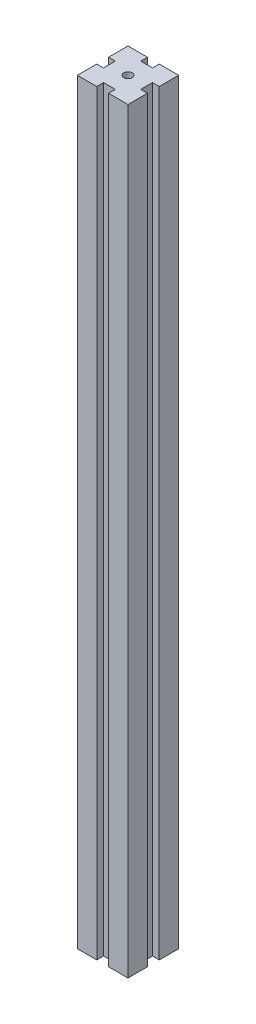
ISO-10303-21;
HEADER;
FILE_DESCRIPTION(('STEP AP214'),'2;1');
FILE_NAME('part.step','',(''),(''),'','','');
FILE_SCHEMA(('AUTOMOTIVE_DESIGN { 1 0 10303 214 1 1 1 1 }'));
ENDSEC;
DATA;
#1=APPLICATION_CONTEXT('core data for automotive mechanical design processes');
#2=APPLICATION_PROTOCOL_DEFINITION('international standard','automotive_design',2000,#1);
#3=PRODUCT_CONTEXT('',#1,'mechanical');
#4=PRODUCT('Part','Part','',(#3));
#5=PRODUCT_RELATED_PRODUCT_CATEGORY('part','',(#4));
#6=PRODUCT_DEFINITION_FORMATION('','',#4);
#7=PRODUCT_DEFINITION_CONTEXT('part definition',#1,'design');
#8=PRODUCT_DEFINITION('design','',#6,#7);
#9=PRODUCT_DEFINITION_SHAPE('','',#8);
#10=(LENGTH_UNIT() NAMED_UNIT(*) SI_UNIT(.MILLI.,.METRE.));
#11=(NAMED_UNIT(*) PLANE_ANGLE_UNIT() SI_UNIT($,.RADIAN.));
#12=(NAMED_UNIT(*) SI_UNIT($,.STERADIAN.) SOLID_ANGLE_UNIT());
#13=UNCERTAINTY_MEASURE_WITH_UNIT(LENGTH_MEASURE(1.E-05),#10,'distance_accuracy_value','');
#14=(GEOMETRIC_REPRESENTATION_CONTEXT(3) GLOBAL_UNCERTAINTY_ASSIGNED_CONTEXT((#13)) GLOBAL_UNIT_ASSIGNED_CONTEXT((#10,
#11,#12)) REPRESENTATION_CONTEXT('',''));
#15=CARTESIAN_POINT('',(0.,0.,0.));
#16=DIRECTION('',(0.,0.,1.));
#17=DIRECTION('',(1.,0.,0.));
#18=AXIS2_PLACEMENT_3D('',#15,#16,#17);
#19=CARTESIAN_POINT('',(0.,224.,-9.25));
#20=DIRECTION('',(0.,0.,-1.));
#21=DIRECTION('',(-1.,0.,0.));
#22=AXIS2_PLACEMENT_3D('',#19,#20,#21);
#23=PLANE('',#22);
#24=DIRECTION('',(1.,0.,0.));
#25=VECTOR('',#24,1.);
#26=CARTESIAN_POINT('',(0.,0.,-9.25));
#27=LINE('',#26,#25);
#28=CARTESIAN_POINT('',(0.,0.,-9.25));
#29=VERTEX_POINT('',#28);
#30=CARTESIAN_POINT('',(2.,0.,-9.25));
#31=VERTEX_POINT('',#30);
#32=EDGE_CURVE('E251',#29,#31,#27,.T.);
#33=ORIENTED_EDGE('',*,*,#32,.T.);
#34=DIRECTION('',(0.,-1.,0.));
#35=VECTOR('',#34,1.);
#36=CARTESIAN_POINT('',(2.,224.,-9.25));
#37=LINE('',#36,#35);
#38=CARTESIAN_POINT('',(2.,224.,-9.25));
#39=VERTEX_POINT('',#38);
#40=EDGE_CURVE('E11',#39,#31,#37,.T.);
#41=ORIENTED_EDGE('',*,*,#40,.F.);
#42=DIRECTION('',(1.,0.,0.));
#43=VECTOR('',#42,1.);
#44=CARTESIAN_POINT('',(0.,224.,-9.25));
#45=LINE('',#44,#43);
#46=CARTESIAN_POINT('',(0.,224.,-9.25));
#47=VERTEX_POINT('',#46);
#48=EDGE_CURVE('E243',#47,#39,#45,.T.);
#49=ORIENTED_EDGE('',*,*,#48,.F.);
#50=DIRECTION('',(0.,-1.,0.));
#51=VECTOR('',#50,1.);
#52=CARTESIAN_POINT('',(0.,224.,-9.25));
#53=LINE('',#52,#51);
#54=EDGE_CURVE('E50',#47,#29,#53,.T.);
#55=ORIENTED_EDGE('',*,*,#54,.T.);
#56=EDGE_LOOP('',(#33,#41,#49,#55));
#57=FACE_BOUND('',#56,.T.);
#58=ADVANCED_FACE('F34',(#57),#23,.F.);
#59=CARTESIAN_POINT('',(2.,224.,0.));
#60=DIRECTION('',(1.,0.,0.));
#61=DIRECTION('',(0.,0.,-1.));
#62=AXIS2_PLACEMENT_3D('',#59,#60,#61);
#63=PLANE('',#62);
#64=DIRECTION('',(0.,0.,1.));
#65=VECTOR('',#64,1.);
#66=CARTESIAN_POINT('',(2.,0.,0.));
#67=LINE('',#66,#65);
#68=CARTESIAN_POINT('',(2.,0.,-5.75));
#69=VERTEX_POINT('',#68);
#70=EDGE_CURVE('E254',#31,#69,#67,.T.);
#71=ORIENTED_EDGE('',*,*,#70,.T.);
#72=DIRECTION('',(0.,-1.,0.));
#73=VECTOR('',#72,1.);
#74=CARTESIAN_POINT('',(2.,224.,-5.75));
#75=LINE('',#74,#73);
#76=CARTESIAN_POINT('',(2.,224.,-5.75));
#77=VERTEX_POINT('',#76);
#78=EDGE_CURVE('E42',#77,#69,#75,.T.);
#79=ORIENTED_EDGE('',*,*,#78,.F.);
#80=DIRECTION('',(0.,0.,1.));
#81=VECTOR('',#80,1.);
#82=CARTESIAN_POINT('',(2.,224.,0.));
#83=LINE('',#82,#81);
#84=EDGE_CURVE('E124',#39,#77,#83,.T.);
#85=ORIENTED_EDGE('',*,*,#84,.F.);
#86=ORIENTED_EDGE('',*,*,#40,.T.);
#87=EDGE_LOOP('',(#71,#79,#85,#86));
#88=FACE_BOUND('',#87,.T.);
#89=ADVANCED_FACE('F339',(#88),#63,.F.);
#90=CARTESIAN_POINT('',(0.,224.,-5.75));
#91=DIRECTION('',(0.,0.,-1.));
#92=DIRECTION('',(-1.,0.,0.));
#93=AXIS2_PLACEMENT_3D('',#90,#91,#92);
#94=PLANE('',#93);
#95=DIRECTION('',(1.,0.,0.));
#96=VECTOR('',#95,1.);
#97=CARTESIAN_POINT('',(0.,0.,-5.75));
#98=LINE('',#97,#96);
#99=CARTESIAN_POINT('',(0.,0.,-5.75));
#100=VERTEX_POINT('',#99);
#101=EDGE_CURVE('E258',#100,#69,#98,.T.);
#102=ORIENTED_EDGE('',*,*,#101,.F.);
#103=DIRECTION('',(0.,-1.,0.));
#104=VECTOR('',#103,1.);
#105=CARTESIAN_POINT('',(0.,224.,-5.75));
#106=LINE('',#105,#104);
#107=CARTESIAN_POINT('',(0.,224.,-5.75));
#108=VERTEX_POINT('',#107);
#109=EDGE_CURVE('E334',#108,#100,#106,.T.);
#110=ORIENTED_EDGE('',*,*,#109,.F.);
#111=DIRECTION('',(1.,0.,0.));
#112=VECTOR('',#111,1.);
#113=CARTESIAN_POINT('',(0.,224.,-5.75));
#114=LINE('',#113,#112);
#115=EDGE_CURVE('E237',#108,#77,#114,.T.);
#116=ORIENTED_EDGE('',*,*,#115,.T.);
#117=ORIENTED_EDGE('',*,*,#78,.T.);
#118=EDGE_LOOP('',(#102,#110,#116,#117));
#119=FACE_BOUND('',#118,.T.);
#120=ADVANCED_FACE('F337',(#119),#94,.T.);
#121=CARTESIAN_POINT('',(0.,224.,0.));
#122=DIRECTION('',(-1.,0.,0.));
#123=DIRECTION('',(0.,0.,1.));
#124=AXIS2_PLACEMENT_3D('',#121,#122,#123);
#125=PLANE('',#124);
#126=DIRECTION('',(0.,0.,-1.));
#127=VECTOR('',#126,1.);
#128=CARTESIAN_POINT('',(0.,0.,0.));
#129=LINE('',#128,#127);
#130=CARTESIAN_POINT('',(0.,0.,0.));
#131=VERTEX_POINT('',#130);
#132=EDGE_CURVE('E264',#131,#100,#129,.T.);
#133=ORIENTED_EDGE('',*,*,#132,.F.);
#134=DIRECTION('',(0.,-1.,0.));
#135=VECTOR('',#134,1.);
#136=CARTESIAN_POINT('',(0.,224.,0.));
#137=LINE('',#136,#135);
#138=CARTESIAN_POINT('',(0.,224.,0.));
#139=VERTEX_POINT('',#138);
#140=EDGE_CURVE('E332',#139,#131,#137,.T.);
#141=ORIENTED_EDGE('',*,*,#140,.F.);
#142=DIRECTION('',(0.,0.,-1.));
#143=VECTOR('',#142,1.);
#144=CARTESIAN_POINT('',(0.,224.,0.));
#145=LINE('',#144,#143);
#146=EDGE_CURVE('E201',#139,#108,#145,.T.);
#147=ORIENTED_EDGE('',*,*,#146,.T.);
#148=ORIENTED_EDGE('',*,*,#109,.T.);
#149=EDGE_LOOP('',(#133,#141,#147,#148));
#150=FACE_BOUND('',#149,.T.);
#151=ADVANCED_FACE('F345',(#150),#125,.T.);
#152=CARTESIAN_POINT('',(0.,224.,0.));
#153=DIRECTION('',(0.,0.,-1.));
#154=DIRECTION('',(-1.,0.,0.));
#155=AXIS2_PLACEMENT_3D('',#152,#153,#154);
#156=PLANE('',#155);
#157=DIRECTION('',(1.,0.,0.));
#158=VECTOR('',#157,1.);
#159=CARTESIAN_POINT('',(0.,0.,0.));
#160=LINE('',#159,#158);
#161=CARTESIAN_POINT('',(5.75,0.,0.));
#162=VERTEX_POINT('',#161);
#163=EDGE_CURVE('E267',#131,#162,#160,.T.);
#164=ORIENTED_EDGE('',*,*,#163,.T.);
#165=DIRECTION('',(0.,-1.,0.));
#166=VECTOR('',#165,1.);
#167=CARTESIAN_POINT('',(5.75,224.,0.));
#168=LINE('',#167,#166);
#169=CARTESIAN_POINT('',(5.75,224.,0.));
#170=VERTEX_POINT('',#169);
#171=EDGE_CURVE('E329',#170,#162,#168,.T.);
#172=ORIENTED_EDGE('',*,*,#171,.F.);
#173=DIRECTION('',(1.,0.,0.));
#174=VECTOR('',#173,1.);
#175=CARTESIAN_POINT('',(0.,224.,0.));
#176=LINE('',#175,#174);
#177=EDGE_CURVE('E225',#139,#170,#176,.T.);
#178=ORIENTED_EDGE('',*,*,#177,.F.);
#179=ORIENTED_EDGE('',*,*,#140,.T.);
#180=EDGE_LOOP('',(#164,#172,#178,#179));
#181=FACE_BOUND('',#180,.T.);
#182=ADVANCED_FACE('F359',(#181),#156,.F.);
#183=CARTESIAN_POINT('',(5.75,224.,0.));
#184=DIRECTION('',(-1.,0.,0.));
#185=DIRECTION('',(0.,0.,1.));
#186=AXIS2_PLACEMENT_3D('',#183,#184,#185);
#187=PLANE('',#186);
#188=DIRECTION('',(0.,0.,-1.));
#189=VECTOR('',#188,1.);
#190=CARTESIAN_POINT('',(5.75,0.,0.));
#191=LINE('',#190,#189);
#192=CARTESIAN_POINT('',(5.75,0.,-2.));
#193=VERTEX_POINT('',#192);
#194=EDGE_CURVE('E269',#162,#193,#191,.T.);
#195=ORIENTED_EDGE('',*,*,#194,.T.);
#196=DIRECTION('',(0.,-1.,0.));
#197=VECTOR('',#196,1.);
#198=CARTESIAN_POINT('',(5.75,224.,-2.));
#199=LINE('',#198,#197);
#200=CARTESIAN_POINT('',(5.75,224.,-2.));
#201=VERTEX_POINT('',#200);
#202=EDGE_CURVE('E326',#201,#193,#199,.T.);
#203=ORIENTED_EDGE('',*,*,#202,.F.);
#204=DIRECTION('',(0.,0.,-1.));
#205=VECTOR('',#204,1.);
#206=CARTESIAN_POINT('',(5.75,224.,0.));
#207=LINE('',#206,#205);
#208=EDGE_CURVE('E232',#170,#201,#207,.T.);
#209=ORIENTED_EDGE('',*,*,#208,.F.);
#210=ORIENTED_EDGE('',*,*,#171,.T.);
#211=EDGE_LOOP('',(#195,#203,#209,#210));
#212=FACE_BOUND('',#211,.T.);
#213=ADVANCED_FACE('F355',(#212),#187,.F.);
#214=CARTESIAN_POINT('',(0.,224.,-2.));
#215=DIRECTION('',(0.,0.,-1.));
#216=DIRECTION('',(-1.,0.,0.));
#217=AXIS2_PLACEMENT_3D('',#214,#215,#216);
#218=PLANE('',#217);
#219=DIRECTION('',(1.,0.,0.));
#220=VECTOR('',#219,1.);
#221=CARTESIAN_POINT('',(0.,0.,-2.));
#222=LINE('',#221,#220);
#223=CARTESIAN_POINT('',(9.25,0.,-2.));
#224=VERTEX_POINT('',#223);
#225=EDGE_CURVE('E272',#193,#224,#222,.T.);
#226=ORIENTED_EDGE('',*,*,#225,.T.);
#227=DIRECTION('',(0.,-1.,0.));
#228=VECTOR('',#227,1.);
#229=CARTESIAN_POINT('',(9.25,224.,-2.));
#230=LINE('',#229,#228);
#231=CARTESIAN_POINT('',(9.25,224.,-2.));
#232=VERTEX_POINT('',#231);
#233=EDGE_CURVE('E324',#232,#224,#230,.T.);
#234=ORIENTED_EDGE('',*,*,#233,.F.);
#235=DIRECTION('',(1.,0.,0.));
#236=VECTOR('',#235,1.);
#237=CARTESIAN_POINT('',(0.,224.,-2.));
#238=LINE('',#237,#236);
#239=EDGE_CURVE('E230',#201,#232,#238,.T.);
#240=ORIENTED_EDGE('',*,*,#239,.F.);
#241=ORIENTED_EDGE('',*,*,#202,.T.);
#242=EDGE_LOOP('',(#226,#234,#240,#241));
#243=FACE_BOUND('',#242,.T.);
#244=ADVANCED_FACE('F358',(#243),#218,.F.);
#245=CARTESIAN_POINT('',(9.25,224.,0.));
#246=DIRECTION('',(-1.,0.,0.));
#247=DIRECTION('',(0.,0.,1.));
#248=AXIS2_PLACEMENT_3D('',#245,#246,#247);
#249=PLANE('',#248);
#250=DIRECTION('',(0.,0.,-1.));
#251=VECTOR('',#250,1.);
#252=CARTESIAN_POINT('',(9.25,0.,0.));
#253=LINE('',#252,#251);
#254=CARTESIAN_POINT('',(9.25,0.,0.));
#255=VERTEX_POINT('',#254);
#256=EDGE_CURVE('E275',#255,#224,#253,.T.);
#257=ORIENTED_EDGE('',*,*,#256,.F.);
#258=DIRECTION('',(0.,-1.,0.));
#259=VECTOR('',#258,1.);
#260=CARTESIAN_POINT('',(9.25,224.,0.));
#261=LINE('',#260,#259);
#262=CARTESIAN_POINT('',(9.25,224.,0.));
#263=VERTEX_POINT('',#262);
#264=EDGE_CURVE('E322',#263,#255,#261,.T.);
#265=ORIENTED_EDGE('',*,*,#264,.F.);
#266=DIRECTION('',(0.,0.,-1.));
#267=VECTOR('',#266,1.);
#268=CARTESIAN_POINT('',(9.25,224.,0.));
#269=LINE('',#268,#267);
#270=EDGE_CURVE('E223',#263,#232,#269,.T.);
#271=ORIENTED_EDGE('',*,*,#270,.T.);
#272=ORIENTED_EDGE('',*,*,#233,.T.);
#273=EDGE_LOOP('',(#257,#265,#271,#272));
#274=FACE_BOUND('',#273,.T.);
#275=ADVANCED_FACE('F363',(#274),#249,.T.);
#276=CARTESIAN_POINT('',(15.,0.,0.));
#277=VERTEX_POINT('',#276);
#278=EDGE_CURVE('E270',#255,#277,#160,.T.);
#279=ORIENTED_EDGE('',*,*,#278,.T.);
#280=DIRECTION('',(0.,-1.,0.));
#281=VECTOR('',#280,1.);
#282=CARTESIAN_POINT('',(15.,224.,0.));
#283=LINE('',#282,#281);
#284=CARTESIAN_POINT('',(15.,224.,0.));
#285=VERTEX_POINT('',#284);
#286=EDGE_CURVE('E319',#285,#277,#283,.T.);
#287=ORIENTED_EDGE('',*,*,#286,.F.);
#288=EDGE_CURVE('E220',#263,#285,#176,.T.);
#289=ORIENTED_EDGE('',*,*,#288,.F.);
#290=ORIENTED_EDGE('',*,*,#264,.T.);
#291=EDGE_LOOP('',(#279,#287,#289,#290));
#292=FACE_BOUND('',#291,.T.);
#293=ADVANCED_FACE('F367',(#292),#156,.F.);
#294=CARTESIAN_POINT('',(15.,224.,0.));
#295=DIRECTION('',(-1.,0.,0.));
#296=DIRECTION('',(0.,0.,1.));
#297=AXIS2_PLACEMENT_3D('',#294,#295,#296);
#298=PLANE('',#297);
#299=DIRECTION('',(0.,0.,-1.));
#300=VECTOR('',#299,1.);
#301=CARTESIAN_POINT('',(15.,0.,0.));
#302=LINE('',#301,#300);
#303=CARTESIAN_POINT('',(15.,0.,-5.75));
#304=VERTEX_POINT('',#303);
#305=EDGE_CURVE('E278',#277,#304,#302,.T.);
#306=ORIENTED_EDGE('',*,*,#305,.T.);
#307=DIRECTION('',(0.,-1.,0.));
#308=VECTOR('',#307,1.);
#309=CARTESIAN_POINT('',(15.,224.,-5.75));
#310=LINE('',#309,#308);
#311=CARTESIAN_POINT('',(15.,224.,-5.75));
#312=VERTEX_POINT('',#311);
#313=EDGE_CURVE('E316',#312,#304,#310,.T.);
#314=ORIENTED_EDGE('',*,*,#313,.F.);
#315=DIRECTION('',(0.,0.,-1.));
#316=VECTOR('',#315,1.);
#317=CARTESIAN_POINT('',(15.,224.,0.));
#318=LINE('',#317,#316);
#319=EDGE_CURVE('E211',#285,#312,#318,.T.);
#320=ORIENTED_EDGE('',*,*,#319,.F.);
#321=ORIENTED_EDGE('',*,*,#286,.T.);
#322=EDGE_LOOP('',(#306,#314,#320,#321));
#323=FACE_BOUND('',#322,.T.);
#324=ADVANCED_FACE('F371',(#323),#298,.F.);
#325=CARTESIAN_POINT('',(0.,224.,-5.74999999999999));
#326=DIRECTION('',(0.,0.,1.));
#327=DIRECTION('',(1.,0.,0.));
#328=AXIS2_PLACEMENT_3D('',#325,#326,#327);
#329=PLANE('',#328);
#330=DIRECTION('',(-1.,0.,0.));
#331=VECTOR('',#330,1.);
#332=CARTESIAN_POINT('',(0.,0.,-5.74999999999999));
#333=LINE('',#332,#331);
#334=CARTESIAN_POINT('',(13.,0.,-5.75));
#335=VERTEX_POINT('',#334);
#336=EDGE_CURVE('E280',#304,#335,#333,.T.);
#337=ORIENTED_EDGE('',*,*,#336,.T.);
#338=DIRECTION('',(0.,-1.,0.));
#339=VECTOR('',#338,1.);
#340=CARTESIAN_POINT('',(13.,224.,-5.75));
#341=LINE('',#340,#339);
#342=CARTESIAN_POINT('',(13.,224.,-5.75));
#343=VERTEX_POINT('',#342);
#344=EDGE_CURVE('E314',#343,#335,#341,.T.);
#345=ORIENTED_EDGE('',*,*,#344,.F.);
#346=DIRECTION('',(-1.,0.,0.));
#347=VECTOR('',#346,1.);
#348=CARTESIAN_POINT('',(0.,224.,-5.74999999999999));
#349=LINE('',#348,#347);
#350=EDGE_CURVE('E219',#312,#343,#349,.T.);
#351=ORIENTED_EDGE('',*,*,#350,.F.);
#352=ORIENTED_EDGE('',*,*,#313,.T.);
#353=EDGE_LOOP('',(#337,#345,#351,#352));
#354=FACE_BOUND('',#353,.T.);
#355=ADVANCED_FACE('F373',(#354),#329,.F.);
#356=CARTESIAN_POINT('',(13.,224.,0.));
#357=DIRECTION('',(1.,0.,0.));
#358=DIRECTION('',(0.,0.,-1.));
#359=AXIS2_PLACEMENT_3D('',#356,#357,#358);
#360=PLANE('',#359);
#361=DIRECTION('',(0.,0.,1.));
#362=VECTOR('',#361,1.);
#363=CARTESIAN_POINT('',(13.,0.,0.));
#364=LINE('',#363,#362);
#365=CARTESIAN_POINT('',(13.,0.,-9.25));
#366=VERTEX_POINT('',#365);
#367=EDGE_CURVE('E284',#366,#335,#364,.T.);
#368=ORIENTED_EDGE('',*,*,#367,.F.);
#369=DIRECTION('',(0.,-1.,0.));
#370=VECTOR('',#369,1.);
#371=CARTESIAN_POINT('',(13.,224.,-9.25));
#372=LINE('',#371,#370);
#373=CARTESIAN_POINT('',(13.,224.,-9.25));
#374=VERTEX_POINT('',#373);
#375=EDGE_CURVE('E312',#374,#366,#372,.T.);
#376=ORIENTED_EDGE('',*,*,#375,.F.);
#377=DIRECTION('',(0.,0.,1.));
#378=VECTOR('',#377,1.);
#379=CARTESIAN_POINT('',(13.,224.,0.));
#380=LINE('',#379,#378);
#381=EDGE_CURVE('E216',#374,#343,#380,.T.);
#382=ORIENTED_EDGE('',*,*,#381,.T.);
#383=ORIENTED_EDGE('',*,*,#344,.T.);
#384=EDGE_LOOP('',(#368,#376,#382,#383));
#385=FACE_BOUND('',#384,.T.);
#386=ADVANCED_FACE('F376',(#385),#360,.T.);
#387=CARTESIAN_POINT('',(0.,224.,-9.25));
#388=DIRECTION('',(0.,0.,1.));
#389=DIRECTION('',(1.,0.,0.));
#390=AXIS2_PLACEMENT_3D('',#387,#388,#389);
#391=PLANE('',#390);
#392=DIRECTION('',(-1.,0.,0.));
#393=VECTOR('',#392,1.);
#394=CARTESIAN_POINT('',(0.,0.,-9.25));
#395=LINE('',#394,#393);
#396=CARTESIAN_POINT('',(15.,0.,-9.25));
#397=VERTEX_POINT('',#396);
#398=EDGE_CURVE('E287',#397,#366,#395,.T.);
#399=ORIENTED_EDGE('',*,*,#398,.F.);
#400=DIRECTION('',(0.,-1.,0.));
#401=VECTOR('',#400,1.);
#402=CARTESIAN_POINT('',(15.,224.,-9.25));
#403=LINE('',#402,#401);
#404=CARTESIAN_POINT('',(15.,224.,-9.25));
#405=VERTEX_POINT('',#404);
#406=EDGE_CURVE('E310',#405,#397,#403,.T.);
#407=ORIENTED_EDGE('',*,*,#406,.F.);
#408=DIRECTION('',(-1.,0.,0.));
#409=VECTOR('',#408,1.);
#410=CARTESIAN_POINT('',(0.,224.,-9.25));
#411=LINE('',#410,#409);
#412=EDGE_CURVE('E209',#405,#374,#411,.T.);
#413=ORIENTED_EDGE('',*,*,#412,.T.);
#414=ORIENTED_EDGE('',*,*,#375,.T.);
#415=EDGE_LOOP('',(#399,#407,#413,#414));
#416=FACE_BOUND('',#415,.T.);
#417=ADVANCED_FACE('F380',(#416),#391,.T.);
#418=CARTESIAN_POINT('',(15.,0.,-15.));
#419=VERTEX_POINT('',#418);
#420=EDGE_CURVE('E281',#397,#419,#302,.T.);
#421=ORIENTED_EDGE('',*,*,#420,.T.);
#422=DIRECTION('',(0.,-1.,0.));
#423=VECTOR('',#422,1.);
#424=CARTESIAN_POINT('',(15.,224.,-15.));
#425=LINE('',#424,#423);
#426=CARTESIAN_POINT('',(15.,224.,-15.));
#427=VERTEX_POINT('',#426);
#428=EDGE_CURVE('E308',#427,#419,#425,.T.);
#429=ORIENTED_EDGE('',*,*,#428,.F.);
#430=EDGE_CURVE('E206',#405,#427,#318,.T.);
#431=ORIENTED_EDGE('',*,*,#430,.F.);
#432=ORIENTED_EDGE('',*,*,#406,.T.);
#433=EDGE_LOOP('',(#421,#429,#431,#432));
#434=FACE_BOUND('',#433,.T.);
#435=ADVANCED_FACE('F384',(#434),#298,.F.);
#436=CARTESIAN_POINT('',(0.,224.,-15.));
#437=DIRECTION('',(0.,0.,-1.));
#438=DIRECTION('',(-1.,0.,0.));
#439=AXIS2_PLACEMENT_3D('',#436,#437,#438);
#440=PLANE('',#439);
#441=DIRECTION('',(1.,0.,0.));
#442=VECTOR('',#441,1.);
#443=CARTESIAN_POINT('',(0.,0.,-15.));
#444=LINE('',#443,#442);
#445=CARTESIAN_POINT('',(9.25,0.,-15.));
#446=VERTEX_POINT('',#445);
#447=EDGE_CURVE('E290',#446,#419,#444,.T.);
#448=ORIENTED_EDGE('',*,*,#447,.F.);
#449=DIRECTION('',(0.,-1.,0.));
#450=VECTOR('',#449,1.);
#451=CARTESIAN_POINT('',(9.25,224.,-15.));
#452=LINE('',#451,#450);
#453=CARTESIAN_POINT('',(9.25,224.,-15.));
#454=VERTEX_POINT('',#453);
#455=EDGE_CURVE('E306',#454,#446,#452,.T.);
#456=ORIENTED_EDGE('',*,*,#455,.F.);
#457=DIRECTION('',(1.,0.,0.));
#458=VECTOR('',#457,1.);
#459=CARTESIAN_POINT('',(0.,224.,-15.));
#460=LINE('',#459,#458);
#461=EDGE_CURVE('E199',#454,#427,#460,.T.);
#462=ORIENTED_EDGE('',*,*,#461,.T.);
#463=ORIENTED_EDGE('',*,*,#428,.T.);
#464=EDGE_LOOP('',(#448,#456,#462,#463));
#465=FACE_BOUND('',#464,.T.);
#466=ADVANCED_FACE('F388',(#465),#440,.T.);
#467=CARTESIAN_POINT('',(9.25,224.,0.));
#468=DIRECTION('',(1.,0.,0.));
#469=DIRECTION('',(0.,0.,-1.));
#470=AXIS2_PLACEMENT_3D('',#467,#468,#469);
#471=PLANE('',#470);
#472=DIRECTION('',(0.,0.,1.));
#473=VECTOR('',#472,1.);
#474=CARTESIAN_POINT('',(9.25,0.,0.));
#475=LINE('',#474,#473);
#476=CARTESIAN_POINT('',(9.25,0.,-13.));
#477=VERTEX_POINT('',#476);
#478=EDGE_CURVE('E293',#446,#477,#475,.T.);
#479=ORIENTED_EDGE('',*,*,#478,.T.);
#480=DIRECTION('',(0.,-1.,0.));
#481=VECTOR('',#480,1.);
#482=CARTESIAN_POINT('',(9.25,224.,-13.));
#483=LINE('',#482,#481);
#484=CARTESIAN_POINT('',(9.25,224.,-13.));
#485=VERTEX_POINT('',#484);
#486=EDGE_CURVE('E304',#485,#477,#483,.T.);
#487=ORIENTED_EDGE('',*,*,#486,.F.);
#488=DIRECTION('',(0.,0.,1.));
#489=VECTOR('',#488,1.);
#490=CARTESIAN_POINT('',(9.25,224.,0.));
#491=LINE('',#490,#489);
#492=EDGE_CURVE('E205',#454,#485,#491,.T.);
#493=ORIENTED_EDGE('',*,*,#492,.F.);
#494=ORIENTED_EDGE('',*,*,#455,.T.);
#495=EDGE_LOOP('',(#479,#487,#493,#494));
#496=FACE_BOUND('',#495,.T.);
#497=ADVANCED_FACE('F390',(#496),#471,.F.);
#498=CARTESIAN_POINT('',(0.,224.,-13.));
#499=DIRECTION('',(0.,0.,-1.));
#500=DIRECTION('',(-1.,0.,0.));
#501=AXIS2_PLACEMENT_3D('',#498,#499,#500);
#502=PLANE('',#501);
#503=DIRECTION('',(1.,0.,0.));
#504=VECTOR('',#503,1.);
#505=CARTESIAN_POINT('',(0.,0.,-13.));
#506=LINE('',#505,#504);
#507=CARTESIAN_POINT('',(5.75,0.,-13.));
#508=VERTEX_POINT('',#507);
#509=EDGE_CURVE('E297',#508,#477,#506,.T.);
#510=ORIENTED_EDGE('',*,*,#509,.F.);
#511=DIRECTION('',(0.,-1.,0.));
#512=VECTOR('',#511,1.);
#513=CARTESIAN_POINT('',(5.75,224.,-13.));
#514=LINE('',#513,#512);
#515=CARTESIAN_POINT('',(5.75,224.,-13.));
#516=VERTEX_POINT('',#515);
#517=EDGE_CURVE('E185',#516,#508,#514,.T.);
#518=ORIENTED_EDGE('',*,*,#517,.F.);
#519=DIRECTION('',(1.,0.,0.));
#520=VECTOR('',#519,1.);
#521=CARTESIAN_POINT('',(0.,224.,-13.));
#522=LINE('',#521,#520);
#523=EDGE_CURVE('E194',#516,#485,#522,.T.);
#524=ORIENTED_EDGE('',*,*,#523,.T.);
#525=ORIENTED_EDGE('',*,*,#486,.T.);
#526=EDGE_LOOP('',(#510,#518,#524,#525));
#527=FACE_BOUND('',#526,.T.);
#528=ADVANCED_FACE('F393',(#527),#502,.T.);
#529=CARTESIAN_POINT('',(5.75,224.,0.));
#530=DIRECTION('',(1.,0.,0.));
#531=DIRECTION('',(0.,0.,-1.));
#532=AXIS2_PLACEMENT_3D('',#529,#530,#531);
#533=PLANE('',#532);
#534=DIRECTION('',(0.,0.,1.));
#535=VECTOR('',#534,1.);
#536=CARTESIAN_POINT('',(5.75,0.,0.));
#537=LINE('',#536,#535);
#538=CARTESIAN_POINT('',(5.75,0.,-15.));
#539=VERTEX_POINT('',#538);
#540=EDGE_CURVE('E181',#539,#508,#537,.T.);
#541=ORIENTED_EDGE('',*,*,#540,.F.);
#542=DIRECTION('',(0.,-1.,0.));
#543=VECTOR('',#542,1.);
#544=CARTESIAN_POINT('',(5.75,224.,-15.));
#545=LINE('',#544,#543);
#546=CARTESIAN_POINT('',(5.75,224.,-15.));
#547=VERTEX_POINT('',#546);
#548=EDGE_CURVE('E176',#547,#539,#545,.T.);
#549=ORIENTED_EDGE('',*,*,#548,.F.);
#550=DIRECTION('',(0.,0.,1.));
#551=VECTOR('',#550,1.);
#552=CARTESIAN_POINT('',(5.75,224.,0.));
#553=LINE('',#552,#551);
#554=EDGE_CURVE('E179',#547,#516,#553,.T.);
#555=ORIENTED_EDGE('',*,*,#554,.T.);
#556=ORIENTED_EDGE('',*,*,#517,.T.);
#557=EDGE_LOOP('',(#541,#549,#555,#556));
#558=FACE_BOUND('',#557,.T.);
#559=ADVANCED_FACE('F178',(#558),#533,.T.);
#560=CARTESIAN_POINT('',(0.,0.,-15.));
#561=VERTEX_POINT('',#560);
#562=EDGE_CURVE('E294',#561,#539,#444,.T.);
#563=ORIENTED_EDGE('',*,*,#562,.F.);
#564=DIRECTION('',(0.,-1.,0.));
#565=VECTOR('',#564,1.);
#566=CARTESIAN_POINT('',(0.,224.,-15.));
#567=LINE('',#566,#565);
#568=CARTESIAN_POINT('',(0.,224.,-15.));
#569=VERTEX_POINT('',#568);
#570=EDGE_CURVE('E112',#569,#561,#567,.T.);
#571=ORIENTED_EDGE('',*,*,#570,.F.);
#572=EDGE_CURVE('E192',#569,#547,#460,.T.);
#573=ORIENTED_EDGE('',*,*,#572,.T.);
#574=ORIENTED_EDGE('',*,*,#548,.T.);
#575=EDGE_LOOP('',(#563,#571,#573,#574));
#576=FACE_BOUND('',#575,.T.);
#577=ADVANCED_FACE('F196',(#576),#440,.T.);
#578=EDGE_CURVE('E245',#29,#561,#129,.T.);
#579=ORIENTED_EDGE('',*,*,#578,.F.);
#580=ORIENTED_EDGE('',*,*,#54,.F.);
#581=EDGE_CURVE('E197',#47,#569,#145,.T.);
#582=ORIENTED_EDGE('',*,*,#581,.T.);
#583=ORIENTED_EDGE('',*,*,#570,.T.);
#584=EDGE_LOOP('',(#579,#580,#582,#583));
#585=FACE_BOUND('',#584,.T.);
#586=ADVANCED_FACE('F402',(#585),#125,.T.);
#587=CARTESIAN_POINT('',(0.,224.,0.));
#588=DIRECTION('',(0.,1.,0.));
#589=DIRECTION('',(0.,0.,1.));
#590=AXIS2_PLACEMENT_3D('',#587,#588,#589);
#591=PLANE('',#590);
#592=CARTESIAN_POINT('',(7.5,224.,-7.5));
#593=DIRECTION('',(0.,1.,0.));
#594=DIRECTION('',(0.,0.,1.));
#595=AXIS2_PLACEMENT_3D('',#592,#593,#594);
#596=CIRCLE('',#595,1.25);
#597=CARTESIAN_POINT('',(7.5,224.,-6.25));
#598=VERTEX_POINT('',#597);
#599=EDGE_CURVE('E246',#598,#598,#596,.T.);
#600=ORIENTED_EDGE('',*,*,#599,.F.);
#601=EDGE_LOOP('',(#600));
#602=FACE_BOUND('',#601,.T.);
#603=ORIENTED_EDGE('',*,*,#48,.T.);
#604=ORIENTED_EDGE('',*,*,#84,.T.);
#605=ORIENTED_EDGE('',*,*,#115,.F.);
#606=ORIENTED_EDGE('',*,*,#146,.F.);
#607=ORIENTED_EDGE('',*,*,#177,.T.);
#608=ORIENTED_EDGE('',*,*,#208,.T.);
#609=ORIENTED_EDGE('',*,*,#239,.T.);
#610=ORIENTED_EDGE('',*,*,#270,.F.);
#611=ORIENTED_EDGE('',*,*,#288,.T.);
#612=ORIENTED_EDGE('',*,*,#319,.T.);
#613=ORIENTED_EDGE('',*,*,#350,.T.);
#614=ORIENTED_EDGE('',*,*,#381,.F.);
#615=ORIENTED_EDGE('',*,*,#412,.F.);
#616=ORIENTED_EDGE('',*,*,#430,.T.);
#617=ORIENTED_EDGE('',*,*,#461,.F.);
#618=ORIENTED_EDGE('',*,*,#492,.T.);
#619=ORIENTED_EDGE('',*,*,#523,.F.);
#620=ORIENTED_EDGE('',*,*,#554,.F.);
#621=ORIENTED_EDGE('',*,*,#572,.F.);
#622=ORIENTED_EDGE('',*,*,#581,.F.);
#623=EDGE_LOOP('',(#603,#604,#605,#606,#607,#608,#609,#610,#611,#612,#613,#614,#615,#616,#617,
#618,#619,#620,#621,#622));
#624=FACE_BOUND('',#623,.T.);
#625=ADVANCED_FACE('F190',(#602,#624),#591,.T.);
#626=CARTESIAN_POINT('',(0.,0.,0.));
#627=DIRECTION('',(0.,1.,0.));
#628=DIRECTION('',(0.,0.,1.));
#629=AXIS2_PLACEMENT_3D('',#626,#627,#628);
#630=PLANE('',#629);
#631=CARTESIAN_POINT('',(7.5,0.,-7.5));
#632=DIRECTION('',(0.,1.,0.));
#633=DIRECTION('',(0.,0.,1.));
#634=AXIS2_PLACEMENT_3D('',#631,#632,#633);
#635=CIRCLE('',#634,1.25);
#636=CARTESIAN_POINT('',(7.5,0.,-6.25));
#637=VERTEX_POINT('',#636);
#638=EDGE_CURVE('E249',#637,#637,#635,.T.);
#639=ORIENTED_EDGE('',*,*,#638,.T.);
#640=EDGE_LOOP('',(#639));
#641=FACE_BOUND('',#640,.T.);
#642=ORIENTED_EDGE('',*,*,#32,.F.);
#643=ORIENTED_EDGE('',*,*,#578,.T.);
#644=ORIENTED_EDGE('',*,*,#562,.T.);
#645=ORIENTED_EDGE('',*,*,#540,.T.);
#646=ORIENTED_EDGE('',*,*,#509,.T.);
#647=ORIENTED_EDGE('',*,*,#478,.F.);
#648=ORIENTED_EDGE('',*,*,#447,.T.);
#649=ORIENTED_EDGE('',*,*,#420,.F.);
#650=ORIENTED_EDGE('',*,*,#398,.T.);
#651=ORIENTED_EDGE('',*,*,#367,.T.);
#652=ORIENTED_EDGE('',*,*,#336,.F.);
#653=ORIENTED_EDGE('',*,*,#305,.F.);
#654=ORIENTED_EDGE('',*,*,#278,.F.);
#655=ORIENTED_EDGE('',*,*,#256,.T.);
#656=ORIENTED_EDGE('',*,*,#225,.F.);
#657=ORIENTED_EDGE('',*,*,#194,.F.);
#658=ORIENTED_EDGE('',*,*,#163,.F.);
#659=ORIENTED_EDGE('',*,*,#132,.T.);
#660=ORIENTED_EDGE('',*,*,#101,.T.);
#661=ORIENTED_EDGE('',*,*,#70,.F.);
#662=EDGE_LOOP('',(#642,#643,#644,#645,#646,#647,#648,#649,#650,#651,#652,#653,#654,#655,#656,
#657,#658,#659,#660,#661));
#663=FACE_BOUND('',#662,.T.);
#664=ADVANCED_FACE('F341',(#641,#663),#630,.F.);
#665=CARTESIAN_POINT('',(7.5,0.,-7.5));
#666=DIRECTION('',(0.,1.,0.));
#667=DIRECTION('',(0.,0.,1.));
#668=AXIS2_PLACEMENT_3D('',#665,#666,#667);
#669=CYLINDRICAL_SURFACE('',#668,1.25);
#670=ORIENTED_EDGE('',*,*,#638,.F.);
#671=EDGE_LOOP('',(#670));
#672=FACE_BOUND('',#671,.T.);
#673=ORIENTED_EDGE('',*,*,#599,.T.);
#674=EDGE_LOOP('',(#673));
#675=FACE_BOUND('',#674,.T.);
#676=ADVANCED_FACE('F407',(#672,#675),#669,.F.);
#677=CLOSED_SHELL('',(#58,#89,#120,#151,#182,#213,#244,#275,#293,#324,#355,#386,#417,#435,#466,
#497,#528,#559,#577,#586,#625,#664,#676));
#678=MANIFOLD_SOLID_BREP('B2',#677);
#679=ADVANCED_BREP_SHAPE_REPRESENTATION('',(#18,#678),#14);
#680=SHAPE_DEFINITION_REPRESENTATION(#9,#679);
ENDSEC;
END-ISO-10303-21;
